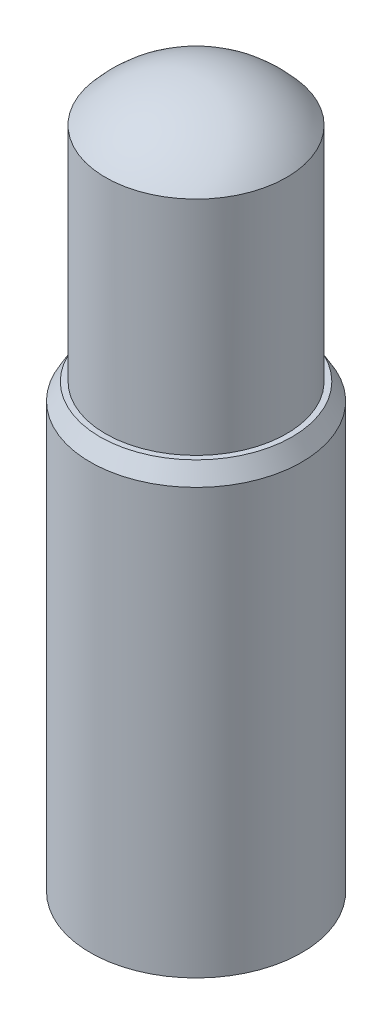
ISO-10303-21;
HEADER;
FILE_DESCRIPTION(('STEP AP214'),'2;1');
FILE_NAME('part.step','',(''),(''),'','','');
FILE_SCHEMA(('AUTOMOTIVE_DESIGN { 1 0 10303 214 1 1 1 1 }'));
ENDSEC;
DATA;
#1=APPLICATION_CONTEXT('core data for automotive mechanical design processes');
#2=APPLICATION_PROTOCOL_DEFINITION('international standard','automotive_design',2000,#1);
#3=PRODUCT_CONTEXT('',#1,'mechanical');
#4=PRODUCT('Part','Part','',(#3));
#5=PRODUCT_RELATED_PRODUCT_CATEGORY('part','',(#4));
#6=PRODUCT_DEFINITION_FORMATION('','',#4);
#7=PRODUCT_DEFINITION_CONTEXT('part definition',#1,'design');
#8=PRODUCT_DEFINITION('design','',#6,#7);
#9=PRODUCT_DEFINITION_SHAPE('','',#8);
#10=(LENGTH_UNIT() NAMED_UNIT(*) SI_UNIT(.MILLI.,.METRE.));
#11=(NAMED_UNIT(*) PLANE_ANGLE_UNIT() SI_UNIT($,.RADIAN.));
#12=(NAMED_UNIT(*) SI_UNIT($,.STERADIAN.) SOLID_ANGLE_UNIT());
#13=UNCERTAINTY_MEASURE_WITH_UNIT(LENGTH_MEASURE(1.E-05),#10,'distance_accuracy_value','');
#14=(GEOMETRIC_REPRESENTATION_CONTEXT(3) GLOBAL_UNCERTAINTY_ASSIGNED_CONTEXT((#13)) GLOBAL_UNIT_ASSIGNED_CONTEXT((#10,
#11,#12)) REPRESENTATION_CONTEXT('',''));
#15=CARTESIAN_POINT('',(0.,0.,0.));
#16=DIRECTION('',(0.,0.,1.));
#17=DIRECTION('',(1.,0.,0.));
#18=AXIS2_PLACEMENT_3D('',#15,#16,#17);
#19=CARTESIAN_POINT('',(4.345,4.04,0.));
#20=DIRECTION('',(0.,-1.,0.));
#21=DIRECTION('',(0.,0.,-1.));
#22=AXIS2_PLACEMENT_3D('',#19,#20,#21);
#23=PLANE('',#22);
#24=CARTESIAN_POINT('',(3.81,4.04,0.));
#25=DIRECTION('',(0.,-1.,0.));
#26=DIRECTION('',(0.,0.,-1.));
#27=AXIS2_PLACEMENT_3D('',#24,#25,#26);
#28=CIRCLE('',#27,0.567264973081037);
#29=CARTESIAN_POINT('',(3.81,4.04,-0.567264973081037));
#30=VERTEX_POINT('',#29);
#31=EDGE_CURVE('E41',#30,#30,#28,.T.);
#32=ORIENTED_EDGE('',*,*,#31,.F.);
#33=EDGE_LOOP('',(#32));
#34=FACE_BOUND('',#33,.T.);
#35=CARTESIAN_POINT('',(3.81,4.04,0.));
#36=DIRECTION('',(0.,-1.,0.));
#37=DIRECTION('',(0.,0.,-1.));
#38=AXIS2_PLACEMENT_3D('',#35,#36,#37);
#39=CIRCLE('',#38,0.535);
#40=CARTESIAN_POINT('',(3.81,4.04,-0.535));
#41=VERTEX_POINT('',#40);
#42=EDGE_CURVE('E10',#41,#41,#39,.T.);
#43=ORIENTED_EDGE('',*,*,#42,.T.);
#44=EDGE_LOOP('',(#43));
#45=FACE_BOUND('',#44,.T.);
#46=ADVANCED_FACE('F14',(#34,#45),#23,.F.);
#47=CARTESIAN_POINT('',(3.81,5.6,0.));
#48=DIRECTION('',(0.,-1.,0.));
#49=DIRECTION('',(0.,0.,-1.));
#50=AXIS2_PLACEMENT_3D('',#47,#48,#49);
#51=CYLINDRICAL_SURFACE('',#50,0.535);
#52=ORIENTED_EDGE('',*,*,#42,.F.);
#53=EDGE_LOOP('',(#52));
#54=FACE_BOUND('',#53,.T.);
#55=CARTESIAN_POINT('',(3.81,5.35141444372107,0.));
#56=DIRECTION('',(0.,-1.,0.));
#57=DIRECTION('',(0.,0.,-1.));
#58=AXIS2_PLACEMENT_3D('',#55,#56,#57);
#59=CIRCLE('',#58,0.535);
#60=CARTESIAN_POINT('',(3.81,5.35141444372107,-0.535));
#61=VERTEX_POINT('',#60);
#62=EDGE_CURVE('E21',#61,#61,#59,.T.);
#63=ORIENTED_EDGE('',*,*,#62,.T.);
#64=EDGE_LOOP('',(#63));
#65=FACE_BOUND('',#64,.T.);
#66=ADVANCED_FACE('F50',(#54,#65),#51,.T.);
#67=CARTESIAN_POINT('',(3.81,4.9,0.));
#68=DIRECTION('',(0.,-1.,0.));
#69=DIRECTION('',(1.,0.,0.));
#70=AXIS2_PLACEMENT_3D('',#67,#68,#69);
#71=SPHERICAL_SURFACE('',#70,0.7);
#72=ORIENTED_EDGE('',*,*,#62,.F.);
#73=EDGE_LOOP('',(#72));
#74=FACE_BOUND('',#73,.T.);
#75=ADVANCED_FACE('F55',(#74),#71,.T.);
#76=CARTESIAN_POINT('',(4.435,1.43,0.));
#77=DIRECTION('',(0.,1.,0.));
#78=DIRECTION('',(0.,0.,1.));
#79=AXIS2_PLACEMENT_3D('',#76,#77,#78);
#80=PLANE('',#79);
#81=CARTESIAN_POINT('',(3.81,1.43,0.));
#82=DIRECTION('',(0.,-1.,0.));
#83=DIRECTION('',(0.,0.,-1.));
#84=AXIS2_PLACEMENT_3D('',#81,#82,#83);
#85=CIRCLE('',#84,0.625);
#86=CARTESIAN_POINT('',(3.81,1.43,-0.625));
#87=VERTEX_POINT('',#86);
#88=EDGE_CURVE('E29',#87,#87,#85,.T.);
#89=ORIENTED_EDGE('',*,*,#88,.T.);
#90=EDGE_LOOP('',(#89));
#91=FACE_BOUND('',#90,.T.);
#92=ADVANCED_FACE('F60',(#91),#80,.F.);
#93=CARTESIAN_POINT('',(3.81,5.6,0.));
#94=DIRECTION('',(0.,-1.,0.));
#95=DIRECTION('',(0.,0.,-1.));
#96=AXIS2_PLACEMENT_3D('',#93,#94,#95);
#97=CYLINDRICAL_SURFACE('',#96,0.625);
#98=ORIENTED_EDGE('',*,*,#88,.F.);
#99=EDGE_LOOP('',(#98));
#100=FACE_BOUND('',#99,.T.);
#101=CARTESIAN_POINT('',(3.81,3.94,0.));
#102=DIRECTION('',(0.,-1.,0.));
#103=DIRECTION('',(0.,0.,-1.));
#104=AXIS2_PLACEMENT_3D('',#101,#102,#103);
#105=CIRCLE('',#104,0.625);
#106=CARTESIAN_POINT('',(3.81,3.94,-0.625));
#107=VERTEX_POINT('',#106);
#108=EDGE_CURVE('E35',#107,#107,#105,.T.);
#109=ORIENTED_EDGE('',*,*,#108,.T.);
#110=EDGE_LOOP('',(#109));
#111=FACE_BOUND('',#110,.T.);
#112=ADVANCED_FACE('F66',(#100,#111),#97,.T.);
#113=CARTESIAN_POINT('',(3.81,4.04,0.));
#114=DIRECTION('',(0.,-1.,0.));
#115=DIRECTION('',(0.,0.,-1.));
#116=AXIS2_PLACEMENT_3D('',#113,#114,#115);
#117=CONICAL_SURFACE('',#116,0.567264973081037,0.523598775598299);
#118=ORIENTED_EDGE('',*,*,#108,.F.);
#119=EDGE_LOOP('',(#118));
#120=FACE_BOUND('',#119,.T.);
#121=ORIENTED_EDGE('',*,*,#31,.T.);
#122=EDGE_LOOP('',(#121));
#123=FACE_BOUND('',#122,.T.);
#124=ADVANCED_FACE('F47',(#120,#123),#117,.T.);
#125=CLOSED_SHELL('',(#46,#66,#75,#92,#112,#124));
#126=MANIFOLD_SOLID_BREP('B1',#125);
#127=ADVANCED_BREP_SHAPE_REPRESENTATION('',(#18,#126),#14);
#128=SHAPE_DEFINITION_REPRESENTATION(#9,#127);
ENDSEC;
END-ISO-10303-21;
